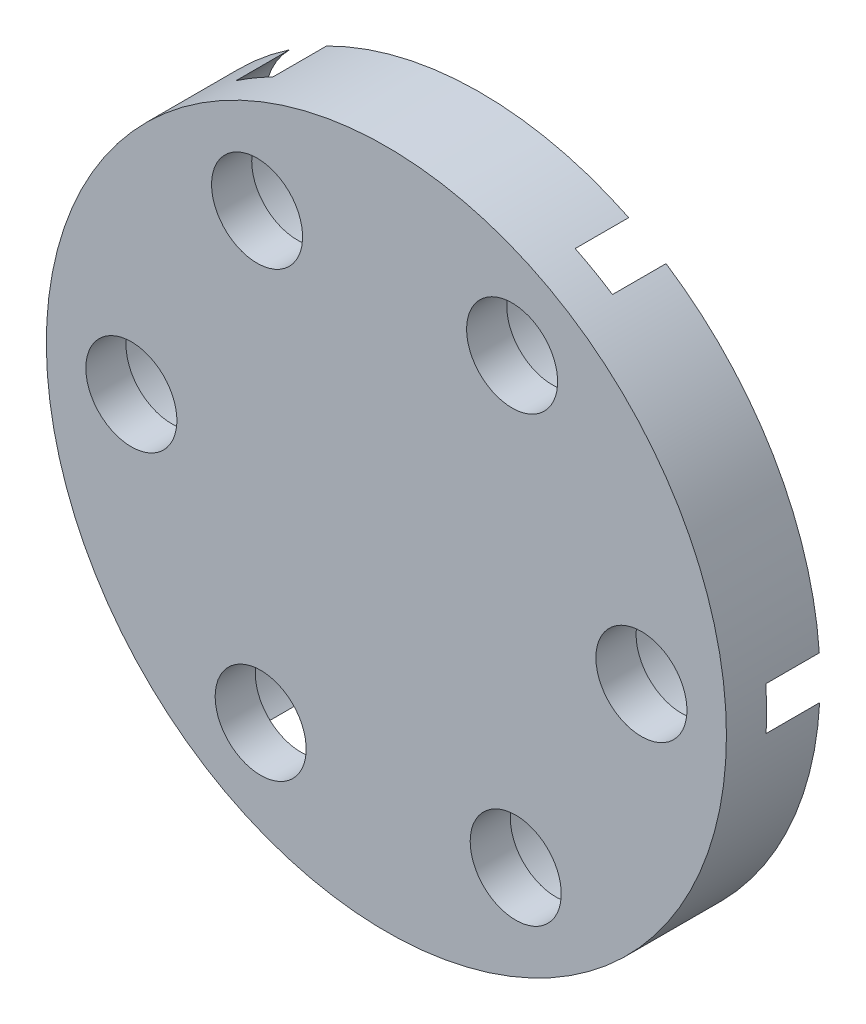
ISO-10303-21;
HEADER;
FILE_DESCRIPTION(('STEP AP214'),'2;1');
FILE_NAME('part.step','',(''),(''),'','','');
FILE_SCHEMA(('AUTOMOTIVE_DESIGN { 1 0 10303 214 1 1 1 1 }'));
ENDSEC;
DATA;
#1=APPLICATION_CONTEXT('core data for automotive mechanical design processes');
#2=APPLICATION_PROTOCOL_DEFINITION('international standard','automotive_design',2000,#1);
#3=PRODUCT_CONTEXT('',#1,'mechanical');
#4=PRODUCT('Part','Part','',(#3));
#5=PRODUCT_RELATED_PRODUCT_CATEGORY('part','',(#4));
#6=PRODUCT_DEFINITION_FORMATION('','',#4);
#7=PRODUCT_DEFINITION_CONTEXT('part definition',#1,'design');
#8=PRODUCT_DEFINITION('design','',#6,#7);
#9=PRODUCT_DEFINITION_SHAPE('','',#8);
#10=(LENGTH_UNIT() NAMED_UNIT(*) SI_UNIT(.MILLI.,.METRE.));
#11=(NAMED_UNIT(*) PLANE_ANGLE_UNIT() SI_UNIT($,.RADIAN.));
#12=(NAMED_UNIT(*) SI_UNIT($,.STERADIAN.) SOLID_ANGLE_UNIT());
#13=UNCERTAINTY_MEASURE_WITH_UNIT(LENGTH_MEASURE(1.E-05),#10,'distance_accuracy_value','');
#14=(GEOMETRIC_REPRESENTATION_CONTEXT(3) GLOBAL_UNCERTAINTY_ASSIGNED_CONTEXT((#13)) GLOBAL_UNIT_ASSIGNED_CONTEXT((#10,
#11,#12)) REPRESENTATION_CONTEXT('',''));
#15=CARTESIAN_POINT('',(0.,0.,0.));
#16=DIRECTION('',(0.,0.,1.));
#17=DIRECTION('',(1.,0.,0.));
#18=AXIS2_PLACEMENT_3D('',#15,#16,#17);
#19=CARTESIAN_POINT('',(0.,0.,0.));
#20=DIRECTION('',(0.,0.,1.));
#21=DIRECTION('',(1.,0.,0.));
#22=AXIS2_PLACEMENT_3D('',#19,#20,#21);
#23=PLANE('',#22);
#24=CARTESIAN_POINT('',(0.,0.,0.));
#25=DIRECTION('',(0.,0.,-1.));
#26=DIRECTION('',(-1.,0.,0.));
#27=AXIS2_PLACEMENT_3D('',#24,#25,#26);
#28=CIRCLE('',#27,6.275);
#29=CARTESIAN_POINT('',(-3.18179412178379,5.40849435301379,0.));
#30=VERTEX_POINT('',#29);
#31=CARTESIAN_POINT('',(3.09299644504274,5.45976171558365,0.));
#32=VERTEX_POINT('',#31);
#33=EDGE_CURVE('E169',#30,#32,#28,.T.);
#34=ORIENTED_EDGE('',*,*,#33,.F.);
#35=CARTESIAN_POINT('',(-4.82973530039691,8.20970656772213,0.));
#36=DIRECTION('',(0.,0.,-1.));
#37=DIRECTION('',(-1.,0.,0.));
#38=AXIS2_PLACEMENT_3D('',#35,#36,#37);
#39=CIRCLE('',#38,3.25);
#40=CARTESIAN_POINT('',(-5.73629038866502,11.3307092706904,0.));
#41=VERTEX_POINT('',#40);
#42=EDGE_CURVE('E145',#41,#30,#39,.T.);
#43=ORIENTED_EDGE('',*,*,#42,.F.);
#44=CARTESIAN_POINT('',(0.,0.,0.));
#45=DIRECTION('',(0.,0.,1.));
#46=DIRECTION('',(1.,0.,0.));
#47=AXIS2_PLACEMENT_3D('',#44,#45,#46);
#48=CIRCLE('',#47,12.7);
#49=CARTESIAN_POINT('',(5.55038476590794,11.4229255863101,0.));
#50=VERTEX_POINT('',#49);
#51=EDGE_CURVE('E324',#50,#41,#48,.T.);
#52=ORIENTED_EDGE('',*,*,#51,.F.);
#53=CARTESIAN_POINT('',(4.69494679506488,8.28752674755925,0.));
#54=DIRECTION('',(0.,0.,-1.));
#55=DIRECTION('',(-1.,0.,0.));
#56=AXIS2_PLACEMENT_3D('',#53,#54,#55);
#57=CIRCLE('',#56,3.25);
#58=EDGE_CURVE('E170',#32,#50,#57,.T.);
#59=ORIENTED_EDGE('',*,*,#58,.F.);
#60=EDGE_LOOP('',(#34,#43,#52,#59));
#61=FACE_BOUND('',#60,.T.);
#62=ADVANCED_FACE('F34',(#61),#23,.F.);
#63=CARTESIAN_POINT('',(6.27479056682652,0.0512673625698373,0.));
#64=VERTEX_POINT('',#63);
#65=EDGE_CURVE('E177',#32,#64,#28,.T.);
#66=ORIENTED_EDGE('',*,*,#65,.F.);
#67=CARTESIAN_POINT('',(6.94453687698126,10.6331278354136,0.));
#68=VERTEX_POINT('',#67);
#69=EDGE_CURVE('E224',#68,#32,#57,.T.);
#70=ORIENTED_EDGE('',*,*,#69,.F.);
#71=CARTESIAN_POINT('',(12.6677361262377,0.90468858510056,0.));
#72=VERTEX_POINT('',#71);
#73=EDGE_CURVE('E314',#72,#68,#48,.T.);
#74=ORIENTED_EDGE('',*,*,#73,.F.);
#75=CARTESIAN_POINT('',(9.52468209546178,0.0778201798370837,0.));
#76=DIRECTION('',(0.,0.,-1.));
#77=DIRECTION('',(-1.,0.,0.));
#78=AXIS2_PLACEMENT_3D('',#75,#76,#77);
#79=CIRCLE('',#78,3.25);
#80=EDGE_CURVE('E212',#64,#72,#79,.T.);
#81=ORIENTED_EDGE('',*,*,#80,.F.);
#82=EDGE_LOOP('',(#66,#70,#74,#81));
#83=FACE_BOUND('',#82,.T.);
#84=ADVANCED_FACE('F312',(#83),#23,.F.);
#85=CARTESIAN_POINT('',(3.18179412178376,-5.40849435301382,0.));
#86=VERTEX_POINT('',#85);
#87=EDGE_CURVE('E57',#64,#86,#28,.T.);
#88=ORIENTED_EDGE('',*,*,#87,.F.);
#89=CARTESIAN_POINT('',(12.6808272656462,-0.697581435276837,0.));
#90=VERTEX_POINT('',#89);
#91=EDGE_CURVE('E213',#90,#64,#79,.T.);
#92=ORIENTED_EDGE('',*,*,#91,.F.);
#93=CARTESIAN_POINT('',(7.11735136032973,-10.5182370012095,0.));
#94=VERTEX_POINT('',#93);
#95=EDGE_CURVE('E322',#94,#90,#48,.T.);
#96=ORIENTED_EDGE('',*,*,#95,.F.);
#97=CARTESIAN_POINT('',(4.82973530039686,-8.20970656772217,0.));
#98=DIRECTION('',(0.,0.,-1.));
#99=DIRECTION('',(-1.,0.,0.));
#100=AXIS2_PLACEMENT_3D('',#97,#98,#99);
#101=CIRCLE('',#100,3.25);
#102=EDGE_CURVE('E200',#86,#94,#101,.T.);
#103=ORIENTED_EDGE('',*,*,#102,.F.);
#104=EDGE_LOOP('',(#88,#92,#96,#103));
#105=FACE_BOUND('',#104,.T.);
#106=ADVANCED_FACE('F321',(#105),#23,.F.);
#107=CARTESIAN_POINT('',(-3.09299644504278,-5.45976171558363,0.));
#108=VERTEX_POINT('',#107);
#109=EDGE_CURVE('E50',#86,#108,#28,.T.);
#110=ORIENTED_EDGE('',*,*,#109,.F.);
#111=CARTESIAN_POINT('',(5.73629038866494,-11.3307092706904,0.));
#112=VERTEX_POINT('',#111);
#113=EDGE_CURVE('E201',#112,#86,#101,.T.);
#114=ORIENTED_EDGE('',*,*,#113,.F.);
#115=CARTESIAN_POINT('',(-5.55038476590804,-11.42292558631,0.));
#116=VERTEX_POINT('',#115);
#117=EDGE_CURVE('E261',#116,#112,#48,.T.);
#118=ORIENTED_EDGE('',*,*,#117,.F.);
#119=CARTESIAN_POINT('',(-4.69494679506494,-8.28752674755922,0.));
#120=DIRECTION('',(0.,0.,-1.));
#121=DIRECTION('',(-1.,0.,0.));
#122=AXIS2_PLACEMENT_3D('',#119,#120,#121);
#123=CIRCLE('',#122,3.25);
#124=EDGE_CURVE('E192',#108,#116,#123,.T.);
#125=ORIENTED_EDGE('',*,*,#124,.F.);
#126=EDGE_LOOP('',(#110,#114,#118,#125));
#127=FACE_BOUND('',#126,.T.);
#128=ADVANCED_FACE('F372',(#127),#23,.F.);
#129=CARTESIAN_POINT('',(-6.27479056682652,-0.051267362569883,0.));
#130=VERTEX_POINT('',#129);
#131=EDGE_CURVE('E180',#108,#130,#28,.T.);
#132=ORIENTED_EDGE('',*,*,#131,.F.);
#133=CARTESIAN_POINT('',(-6.94453687698132,-10.6331278354136,0.));
#134=VERTEX_POINT('',#133);
#135=EDGE_CURVE('E188',#134,#108,#123,.T.);
#136=ORIENTED_EDGE('',*,*,#135,.F.);
#137=CARTESIAN_POINT('',(-12.6677361262377,-0.904688585100667,0.));
#138=VERTEX_POINT('',#137);
#139=EDGE_CURVE('E258',#138,#134,#48,.T.);
#140=ORIENTED_EDGE('',*,*,#139,.F.);
#141=CARTESIAN_POINT('',(-9.52468209546178,-0.0778201798371531,0.));
#142=DIRECTION('',(0.,0.,-1.));
#143=DIRECTION('',(-1.,0.,0.));
#144=AXIS2_PLACEMENT_3D('',#141,#142,#143);
#145=CIRCLE('',#144,3.25);
#146=EDGE_CURVE('E241',#130,#138,#145,.T.);
#147=ORIENTED_EDGE('',*,*,#146,.F.);
#148=EDGE_LOOP('',(#132,#136,#140,#147));
#149=FACE_BOUND('',#148,.T.);
#150=ADVANCED_FACE('F337',(#149),#23,.F.);
#151=EDGE_CURVE('E163',#130,#30,#28,.T.);
#152=ORIENTED_EDGE('',*,*,#151,.F.);
#153=CARTESIAN_POINT('',(-12.6808272656462,0.697581435276758,0.));
#154=VERTEX_POINT('',#153);
#155=EDGE_CURVE('E242',#154,#130,#145,.T.);
#156=ORIENTED_EDGE('',*,*,#155,.F.);
#157=CARTESIAN_POINT('',(-7.11735136032981,10.5182370012094,0.));
#158=VERTEX_POINT('',#157);
#159=EDGE_CURVE('E165',#158,#154,#48,.T.);
#160=ORIENTED_EDGE('',*,*,#159,.F.);
#161=EDGE_CURVE('E148',#30,#158,#39,.T.);
#162=ORIENTED_EDGE('',*,*,#161,.F.);
#163=EDGE_LOOP('',(#152,#156,#160,#162));
#164=FACE_BOUND('',#163,.T.);
#165=ADVANCED_FACE('F160',(#164),#23,.F.);
#166=CARTESIAN_POINT('',(0.,0.,3.5));
#167=DIRECTION('',(0.,0.,-1.));
#168=DIRECTION('',(-1.,0.,0.));
#169=AXIS2_PLACEMENT_3D('',#166,#167,#168);
#170=CYLINDRICAL_SURFACE('',#169,12.7);
#171=ORIENTED_EDGE('',*,*,#139,.T.);
#172=DIRECTION('',(0.,0.,-1.));
#173=VECTOR('',#172,1.);
#174=CARTESIAN_POINT('',(-6.94453687698132,-10.6331278354136,1.));
#175=LINE('',#174,#173);
#176=CARTESIAN_POINT('',(-6.94453687698131,-10.6331278354136,2.));
#177=VERTEX_POINT('',#176);
#178=EDGE_CURVE('E181',#134,#177,#175,.F.);
#179=ORIENTED_EDGE('',*,*,#178,.T.);
#180=CARTESIAN_POINT('',(0.,0.,2.));
#181=DIRECTION('',(0.,0.,1.));
#182=DIRECTION('',(1.,0.,0.));
#183=AXIS2_PLACEMENT_3D('',#180,#181,#182);
#184=CIRCLE('',#183,12.7);
#185=CARTESIAN_POINT('',(-5.55038476590805,-11.42292558631,2.));
#186=VERTEX_POINT('',#185);
#187=EDGE_CURVE('E303',#177,#186,#184,.T.);
#188=ORIENTED_EDGE('',*,*,#187,.T.);
#189=DIRECTION('',(0.,0.,-1.));
#190=VECTOR('',#189,1.);
#191=CARTESIAN_POINT('',(-5.55038476590804,-11.42292558631,1.));
#192=LINE('',#191,#190);
#193=EDGE_CURVE('E183',#186,#116,#192,.T.);
#194=ORIENTED_EDGE('',*,*,#193,.T.);
#195=ORIENTED_EDGE('',*,*,#117,.T.);
#196=DIRECTION('',(0.,0.,-1.));
#197=VECTOR('',#196,1.);
#198=CARTESIAN_POINT('',(5.73629038866495,-11.3307092706904,1.));
#199=LINE('',#198,#197);
#200=CARTESIAN_POINT('',(5.73629038866495,-11.3307092706904,2.));
#201=VERTEX_POINT('',#200);
#202=EDGE_CURVE('E300',#112,#201,#199,.F.);
#203=ORIENTED_EDGE('',*,*,#202,.T.);
#204=CARTESIAN_POINT('',(0.,0.,2.));
#205=DIRECTION('',(0.,0.,1.));
#206=DIRECTION('',(1.,0.,0.));
#207=AXIS2_PLACEMENT_3D('',#204,#205,#206);
#208=CIRCLE('',#207,12.7);
#209=CARTESIAN_POINT('',(7.11735136032972,-10.5182370012095,2.));
#210=VERTEX_POINT('',#209);
#211=EDGE_CURVE('E294',#201,#210,#208,.T.);
#212=ORIENTED_EDGE('',*,*,#211,.T.);
#213=DIRECTION('',(0.,0.,-1.));
#214=VECTOR('',#213,1.);
#215=CARTESIAN_POINT('',(7.11735136032973,-10.5182370012095,1.));
#216=LINE('',#215,#214);
#217=EDGE_CURVE('E297',#210,#94,#216,.T.);
#218=ORIENTED_EDGE('',*,*,#217,.T.);
#219=ORIENTED_EDGE('',*,*,#95,.T.);
#220=DIRECTION('',(0.,0.,-1.));
#221=VECTOR('',#220,1.);
#222=CARTESIAN_POINT('',(12.6808272656462,-0.69758143527685,1.));
#223=LINE('',#222,#221);
#224=CARTESIAN_POINT('',(12.6808272656462,-0.697581435276837,2.));
#225=VERTEX_POINT('',#224);
#226=EDGE_CURVE('E291',#90,#225,#223,.F.);
#227=ORIENTED_EDGE('',*,*,#226,.T.);
#228=CARTESIAN_POINT('',(0.,0.,2.));
#229=DIRECTION('',(0.,0.,1.));
#230=DIRECTION('',(1.,0.,0.));
#231=AXIS2_PLACEMENT_3D('',#228,#229,#230);
#232=CIRCLE('',#231,12.7);
#233=CARTESIAN_POINT('',(12.6677361262377,0.90468858510056,2.));
#234=VERTEX_POINT('',#233);
#235=EDGE_CURVE('E285',#225,#234,#232,.T.);
#236=ORIENTED_EDGE('',*,*,#235,.T.);
#237=DIRECTION('',(0.,0.,-1.));
#238=VECTOR('',#237,1.);
#239=CARTESIAN_POINT('',(12.6677361262377,0.904688585100572,1.));
#240=LINE('',#239,#238);
#241=EDGE_CURVE('E288',#234,#72,#240,.T.);
#242=ORIENTED_EDGE('',*,*,#241,.T.);
#243=ORIENTED_EDGE('',*,*,#73,.T.);
#244=DIRECTION('',(0.,0.,-1.));
#245=VECTOR('',#244,1.);
#246=CARTESIAN_POINT('',(6.94453687698126,10.6331278354136,1.));
#247=LINE('',#246,#245);
#248=CARTESIAN_POINT('',(6.94453687698125,10.6331278354136,2.));
#249=VERTEX_POINT('',#248);
#250=EDGE_CURVE('E282',#68,#249,#247,.F.);
#251=ORIENTED_EDGE('',*,*,#250,.T.);
#252=CARTESIAN_POINT('',(0.,0.,2.));
#253=DIRECTION('',(0.,0.,1.));
#254=DIRECTION('',(1.,0.,0.));
#255=AXIS2_PLACEMENT_3D('',#252,#253,#254);
#256=CIRCLE('',#255,12.7);
#257=CARTESIAN_POINT('',(5.55038476590795,11.4229255863101,2.));
#258=VERTEX_POINT('',#257);
#259=EDGE_CURVE('E276',#249,#258,#256,.T.);
#260=ORIENTED_EDGE('',*,*,#259,.T.);
#261=DIRECTION('',(0.,0.,-1.));
#262=VECTOR('',#261,1.);
#263=CARTESIAN_POINT('',(5.55038476590795,11.4229255863101,1.));
#264=LINE('',#263,#262);
#265=EDGE_CURVE('E279',#258,#50,#264,.T.);
#266=ORIENTED_EDGE('',*,*,#265,.T.);
#267=ORIENTED_EDGE('',*,*,#51,.T.);
#268=DIRECTION('',(0.,0.,-1.));
#269=VECTOR('',#268,1.);
#270=CARTESIAN_POINT('',(-5.73629038866501,11.3307092706904,1.));
#271=LINE('',#270,#269);
#272=CARTESIAN_POINT('',(-5.73629038866502,11.3307092706904,2.));
#273=VERTEX_POINT('',#272);
#274=EDGE_CURVE('E152',#41,#273,#271,.F.);
#275=ORIENTED_EDGE('',*,*,#274,.T.);
#276=CARTESIAN_POINT('',(0.,0.,2.));
#277=DIRECTION('',(0.,0.,1.));
#278=DIRECTION('',(1.,0.,0.));
#279=AXIS2_PLACEMENT_3D('',#276,#277,#278);
#280=CIRCLE('',#279,12.7);
#281=CARTESIAN_POINT('',(-7.11735136032981,10.5182370012094,2.));
#282=VERTEX_POINT('',#281);
#283=EDGE_CURVE('E272',#273,#282,#280,.T.);
#284=ORIENTED_EDGE('',*,*,#283,.T.);
#285=DIRECTION('',(0.,0.,-1.));
#286=VECTOR('',#285,1.);
#287=CARTESIAN_POINT('',(-7.11735136032981,10.5182370012094,1.));
#288=LINE('',#287,#286);
#289=EDGE_CURVE('E270',#282,#158,#288,.T.);
#290=ORIENTED_EDGE('',*,*,#289,.T.);
#291=ORIENTED_EDGE('',*,*,#159,.T.);
#292=DIRECTION('',(0.,0.,-1.));
#293=VECTOR('',#292,1.);
#294=CARTESIAN_POINT('',(-12.6808272656462,0.697581435276758,1.));
#295=LINE('',#294,#293);
#296=CARTESIAN_POINT('',(-12.6808272656462,0.697581435276757,2.));
#297=VERTEX_POINT('',#296);
#298=EDGE_CURVE('E267',#154,#297,#295,.F.);
#299=ORIENTED_EDGE('',*,*,#298,.T.);
#300=CARTESIAN_POINT('',(0.,0.,2.));
#301=DIRECTION('',(0.,0.,1.));
#302=DIRECTION('',(1.,0.,0.));
#303=AXIS2_PLACEMENT_3D('',#300,#301,#302);
#304=CIRCLE('',#303,12.7);
#305=CARTESIAN_POINT('',(-12.6677361262377,-0.904688585100667,2.));
#306=VERTEX_POINT('',#305);
#307=EDGE_CURVE('E264',#297,#306,#304,.T.);
#308=ORIENTED_EDGE('',*,*,#307,.T.);
#309=DIRECTION('',(0.,0.,-1.));
#310=VECTOR('',#309,1.);
#311=CARTESIAN_POINT('',(-12.6677361262377,-0.904688585100665,1.));
#312=LINE('',#311,#310);
#313=EDGE_CURVE('E257',#306,#138,#312,.T.);
#314=ORIENTED_EDGE('',*,*,#313,.T.);
#315=EDGE_LOOP('',(#171,#179,#188,#194,#195,#203,#212,#218,#219,#227,#236,#242,#243,#251,#260,
#266,#267,#275,#284,#290,#291,#299,#308,#314));
#316=FACE_BOUND('',#315,.T.);
#317=CARTESIAN_POINT('',(0.,0.,3.5));
#318=DIRECTION('',(0.,0.,1.));
#319=DIRECTION('',(1.,0.,0.));
#320=AXIS2_PLACEMENT_3D('',#317,#318,#319);
#321=CIRCLE('',#320,12.7);
#322=CARTESIAN_POINT('',(12.7,0.,3.5));
#323=VERTEX_POINT('',#322);
#324=EDGE_CURVE('E254',#323,#323,#321,.T.);
#325=ORIENTED_EDGE('',*,*,#324,.F.);
#326=EDGE_LOOP('',(#325));
#327=FACE_BOUND('',#326,.T.);
#328=ADVANCED_FACE('F327',(#316,#327),#170,.T.);
#329=CARTESIAN_POINT('',(0.,0.,3.5));
#330=DIRECTION('',(0.,0.,1.));
#331=DIRECTION('',(1.,0.,0.));
#332=AXIS2_PLACEMENT_3D('',#329,#330,#331);
#333=PLANE('',#332);
#334=CARTESIAN_POINT('',(-4.69494679506494,-8.28752674755922,3.5));
#335=DIRECTION('',(0.,0.,-1.));
#336=DIRECTION('',(-1.,0.,0.));
#337=AXIS2_PLACEMENT_3D('',#334,#335,#336);
#338=CIRCLE('',#337,1.7);
#339=CARTESIAN_POINT('',(-6.39494679506494,-8.28752674755922,3.5));
#340=VERTEX_POINT('',#339);
#341=EDGE_CURVE('E197',#340,#340,#338,.T.);
#342=ORIENTED_EDGE('',*,*,#341,.T.);
#343=EDGE_LOOP('',(#342));
#344=FACE_BOUND('',#343,.T.);
#345=CARTESIAN_POINT('',(4.82973530039686,-8.20970656772217,3.5));
#346=DIRECTION('',(0.,0.,-1.));
#347=DIRECTION('',(-1.,0.,0.));
#348=AXIS2_PLACEMENT_3D('',#345,#346,#347);
#349=CIRCLE('',#348,1.7);
#350=CARTESIAN_POINT('',(3.12973530039686,-8.20970656772217,3.5));
#351=VERTEX_POINT('',#350);
#352=EDGE_CURVE('E209',#351,#351,#349,.T.);
#353=ORIENTED_EDGE('',*,*,#352,.T.);
#354=EDGE_LOOP('',(#353));
#355=FACE_BOUND('',#354,.T.);
#356=CARTESIAN_POINT('',(9.52468209546178,0.0778201798370837,3.5));
#357=DIRECTION('',(0.,0.,-1.));
#358=DIRECTION('',(-1.,0.,0.));
#359=AXIS2_PLACEMENT_3D('',#356,#357,#358);
#360=CIRCLE('',#359,1.7);
#361=CARTESIAN_POINT('',(7.82468209546178,0.0778201798370837,3.5));
#362=VERTEX_POINT('',#361);
#363=EDGE_CURVE('E221',#362,#362,#360,.T.);
#364=ORIENTED_EDGE('',*,*,#363,.T.);
#365=EDGE_LOOP('',(#364));
#366=FACE_BOUND('',#365,.T.);
#367=CARTESIAN_POINT('',(4.69494679506488,8.28752674755925,3.5));
#368=DIRECTION('',(0.,0.,-1.));
#369=DIRECTION('',(-1.,0.,0.));
#370=AXIS2_PLACEMENT_3D('',#367,#368,#369);
#371=CIRCLE('',#370,1.7);
#372=CARTESIAN_POINT('',(2.99494679506488,8.28752674755925,3.5));
#373=VERTEX_POINT('',#372);
#374=EDGE_CURVE('E166',#373,#373,#371,.T.);
#375=ORIENTED_EDGE('',*,*,#374,.T.);
#376=EDGE_LOOP('',(#375));
#377=FACE_BOUND('',#376,.T.);
#378=CARTESIAN_POINT('',(-4.82973530039691,8.20970656772213,3.5));
#379=DIRECTION('',(0.,0.,-1.));
#380=DIRECTION('',(-1.,0.,0.));
#381=AXIS2_PLACEMENT_3D('',#378,#379,#380);
#382=CIRCLE('',#381,1.7);
#383=CARTESIAN_POINT('',(-6.52973530039691,8.20970656772213,3.5));
#384=VERTEX_POINT('',#383);
#385=EDGE_CURVE('E238',#384,#384,#382,.T.);
#386=ORIENTED_EDGE('',*,*,#385,.T.);
#387=EDGE_LOOP('',(#386));
#388=FACE_BOUND('',#387,.T.);
#389=CARTESIAN_POINT('',(-9.52468209546178,-0.0778201798371531,3.5));
#390=DIRECTION('',(0.,0.,-1.));
#391=DIRECTION('',(-1.,0.,0.));
#392=AXIS2_PLACEMENT_3D('',#389,#390,#391);
#393=CIRCLE('',#392,1.7);
#394=CARTESIAN_POINT('',(-11.2246820954618,-0.0778201798371531,3.5));
#395=VERTEX_POINT('',#394);
#396=EDGE_CURVE('E251',#395,#395,#393,.T.);
#397=ORIENTED_EDGE('',*,*,#396,.T.);
#398=EDGE_LOOP('',(#397));
#399=FACE_BOUND('',#398,.T.);
#400=ORIENTED_EDGE('',*,*,#324,.T.);
#401=EDGE_LOOP('',(#400));
#402=FACE_BOUND('',#401,.T.);
#403=ADVANCED_FACE('F371',(#344,#355,#366,#377,#388,#399,#402),#333,.T.);
#404=CARTESIAN_POINT('',(-7.82468209546178,-0.0778201798371531,2.));
#405=DIRECTION('',(0.,0.,1.));
#406=DIRECTION('',(1.,0.,0.));
#407=AXIS2_PLACEMENT_3D('',#404,#405,#406);
#408=PLANE('',#407);
#409=CARTESIAN_POINT('',(-9.52468209546178,-0.0778201798371531,2.));
#410=DIRECTION('',(0.,0.,-1.));
#411=DIRECTION('',(-1.,0.,0.));
#412=AXIS2_PLACEMENT_3D('',#409,#410,#411);
#413=CIRCLE('',#412,1.7);
#414=CARTESIAN_POINT('',(-11.2246820954618,-0.0778201798371531,2.));
#415=VERTEX_POINT('',#414);
#416=EDGE_CURVE('E248',#415,#415,#413,.T.);
#417=ORIENTED_EDGE('',*,*,#416,.F.);
#418=EDGE_LOOP('',(#417));
#419=FACE_BOUND('',#418,.T.);
#420=CARTESIAN_POINT('',(-9.52468209546178,-0.0778201798371531,2.));
#421=DIRECTION('',(0.,0.,-1.));
#422=DIRECTION('',(-1.,0.,0.));
#423=AXIS2_PLACEMENT_3D('',#420,#421,#422);
#424=CIRCLE('',#423,3.25);
#425=EDGE_CURVE('E245',#297,#306,#424,.T.);
#426=ORIENTED_EDGE('',*,*,#425,.T.);
#427=ORIENTED_EDGE('',*,*,#307,.F.);
#428=EDGE_LOOP('',(#426,#427));
#429=FACE_BOUND('',#428,.T.);
#430=ADVANCED_FACE('F333',(#419,#429),#408,.F.);
#431=CARTESIAN_POINT('',(-9.52468209546178,-0.0778201798371531,0.));
#432=DIRECTION('',(0.,0.,-1.));
#433=DIRECTION('',(-1.,0.,0.));
#434=AXIS2_PLACEMENT_3D('',#431,#432,#433);
#435=CYLINDRICAL_SURFACE('',#434,3.25);
#436=ORIENTED_EDGE('',*,*,#155,.T.);
#437=ORIENTED_EDGE('',*,*,#146,.T.);
#438=ORIENTED_EDGE('',*,*,#313,.F.);
#439=ORIENTED_EDGE('',*,*,#425,.F.);
#440=ORIENTED_EDGE('',*,*,#298,.F.);
#441=EDGE_LOOP('',(#436,#437,#438,#439,#440));
#442=FACE_BOUND('',#441,.T.);
#443=ADVANCED_FACE('F331',(#442),#435,.F.);
#444=CARTESIAN_POINT('',(-9.52468209546178,-0.0778201798371531,0.));
#445=DIRECTION('',(0.,0.,-1.));
#446=DIRECTION('',(-1.,0.,0.));
#447=AXIS2_PLACEMENT_3D('',#444,#445,#446);
#448=CYLINDRICAL_SURFACE('',#447,1.7);
#449=ORIENTED_EDGE('',*,*,#396,.F.);
#450=EDGE_LOOP('',(#449));
#451=FACE_BOUND('',#450,.T.);
#452=ORIENTED_EDGE('',*,*,#416,.T.);
#453=EDGE_LOOP('',(#452));
#454=FACE_BOUND('',#453,.T.);
#455=ADVANCED_FACE('F540',(#451,#454),#448,.F.);
#456=CARTESIAN_POINT('',(-3.12973530039691,8.20970656772213,2.));
#457=DIRECTION('',(0.,0.,1.));
#458=DIRECTION('',(1.,0.,0.));
#459=AXIS2_PLACEMENT_3D('',#456,#457,#458);
#460=PLANE('',#459);
#461=CARTESIAN_POINT('',(-4.82973530039691,8.20970656772213,2.));
#462=DIRECTION('',(0.,0.,-1.));
#463=DIRECTION('',(-1.,0.,0.));
#464=AXIS2_PLACEMENT_3D('',#461,#462,#463);
#465=CIRCLE('',#464,1.7);
#466=CARTESIAN_POINT('',(-6.52973530039691,8.20970656772213,2.));
#467=VERTEX_POINT('',#466);
#468=EDGE_CURVE('E235',#467,#467,#465,.T.);
#469=ORIENTED_EDGE('',*,*,#468,.F.);
#470=EDGE_LOOP('',(#469));
#471=FACE_BOUND('',#470,.T.);
#472=CARTESIAN_POINT('',(-4.82973530039691,8.20970656772213,2.));
#473=DIRECTION('',(0.,0.,-1.));
#474=DIRECTION('',(-1.,0.,0.));
#475=AXIS2_PLACEMENT_3D('',#472,#473,#474);
#476=CIRCLE('',#475,3.25);
#477=EDGE_CURVE('E156',#273,#282,#476,.T.);
#478=ORIENTED_EDGE('',*,*,#477,.T.);
#479=ORIENTED_EDGE('',*,*,#283,.F.);
#480=EDGE_LOOP('',(#478,#479));
#481=FACE_BOUND('',#480,.T.);
#482=ADVANCED_FACE('F535',(#471,#481),#460,.F.);
#483=CARTESIAN_POINT('',(-4.82973530039691,8.20970656772213,0.));
#484=DIRECTION('',(0.,0.,-1.));
#485=DIRECTION('',(-1.,0.,0.));
#486=AXIS2_PLACEMENT_3D('',#483,#484,#485);
#487=CYLINDRICAL_SURFACE('',#486,3.25);
#488=ORIENTED_EDGE('',*,*,#42,.T.);
#489=ORIENTED_EDGE('',*,*,#161,.T.);
#490=ORIENTED_EDGE('',*,*,#289,.F.);
#491=ORIENTED_EDGE('',*,*,#477,.F.);
#492=ORIENTED_EDGE('',*,*,#274,.F.);
#493=EDGE_LOOP('',(#488,#489,#490,#491,#492));
#494=FACE_BOUND('',#493,.T.);
#495=ADVANCED_FACE('F147',(#494),#487,.F.);
#496=CARTESIAN_POINT('',(-4.82973530039691,8.20970656772213,0.));
#497=DIRECTION('',(0.,0.,-1.));
#498=DIRECTION('',(-1.,0.,0.));
#499=AXIS2_PLACEMENT_3D('',#496,#497,#498);
#500=CYLINDRICAL_SURFACE('',#499,1.7);
#501=ORIENTED_EDGE('',*,*,#385,.F.);
#502=EDGE_LOOP('',(#501));
#503=FACE_BOUND('',#502,.T.);
#504=ORIENTED_EDGE('',*,*,#468,.T.);
#505=EDGE_LOOP('',(#504));
#506=FACE_BOUND('',#505,.T.);
#507=ADVANCED_FACE('F523',(#503,#506),#500,.F.);
#508=CARTESIAN_POINT('',(4.69494679506488,8.28752674755925,0.));
#509=DIRECTION('',(0.,0.,-1.));
#510=DIRECTION('',(-1.,0.,0.));
#511=AXIS2_PLACEMENT_3D('',#508,#509,#510);
#512=CYLINDRICAL_SURFACE('',#511,3.25);
#513=ORIENTED_EDGE('',*,*,#69,.T.);
#514=ORIENTED_EDGE('',*,*,#58,.T.);
#515=ORIENTED_EDGE('',*,*,#265,.F.);
#516=CARTESIAN_POINT('',(4.69494679506488,8.28752674755925,2.));
#517=DIRECTION('',(0.,0.,-1.));
#518=DIRECTION('',(-1.,0.,0.));
#519=AXIS2_PLACEMENT_3D('',#516,#517,#518);
#520=CIRCLE('',#519,3.25);
#521=EDGE_CURVE('E226',#249,#258,#520,.T.);
#522=ORIENTED_EDGE('',*,*,#521,.F.);
#523=ORIENTED_EDGE('',*,*,#250,.F.);
#524=EDGE_LOOP('',(#513,#514,#515,#522,#523));
#525=FACE_BOUND('',#524,.T.);
#526=ADVANCED_FACE('F515',(#525),#512,.F.);
#527=CARTESIAN_POINT('',(6.39494679506488,8.28752674755925,2.));
#528=DIRECTION('',(0.,0.,1.));
#529=DIRECTION('',(1.,0.,0.));
#530=AXIS2_PLACEMENT_3D('',#527,#528,#529);
#531=PLANE('',#530);
#532=CARTESIAN_POINT('',(4.69494679506488,8.28752674755925,2.));
#533=DIRECTION('',(0.,0.,-1.));
#534=DIRECTION('',(-1.,0.,0.));
#535=AXIS2_PLACEMENT_3D('',#532,#533,#534);
#536=CIRCLE('',#535,1.7);
#537=CARTESIAN_POINT('',(2.99494679506488,8.28752674755925,2.));
#538=VERTEX_POINT('',#537);
#539=EDGE_CURVE('E228',#538,#538,#536,.T.);
#540=ORIENTED_EDGE('',*,*,#539,.F.);
#541=EDGE_LOOP('',(#540));
#542=FACE_BOUND('',#541,.T.);
#543=ORIENTED_EDGE('',*,*,#521,.T.);
#544=ORIENTED_EDGE('',*,*,#259,.F.);
#545=EDGE_LOOP('',(#543,#544));
#546=FACE_BOUND('',#545,.T.);
#547=ADVANCED_FACE('F505',(#542,#546),#531,.F.);
#548=CARTESIAN_POINT('',(4.69494679506488,8.28752674755925,0.));
#549=DIRECTION('',(0.,0.,-1.));
#550=DIRECTION('',(-1.,0.,0.));
#551=AXIS2_PLACEMENT_3D('',#548,#549,#550);
#552=CYLINDRICAL_SURFACE('',#551,1.7);
#553=ORIENTED_EDGE('',*,*,#374,.F.);
#554=EDGE_LOOP('',(#553));
#555=FACE_BOUND('',#554,.T.);
#556=ORIENTED_EDGE('',*,*,#539,.T.);
#557=EDGE_LOOP('',(#556));
#558=FACE_BOUND('',#557,.T.);
#559=ADVANCED_FACE('F500',(#555,#558),#552,.F.);
#560=CARTESIAN_POINT('',(9.52468209546178,0.0778201798370837,0.));
#561=DIRECTION('',(0.,0.,-1.));
#562=DIRECTION('',(-1.,0.,0.));
#563=AXIS2_PLACEMENT_3D('',#560,#561,#562);
#564=CYLINDRICAL_SURFACE('',#563,3.25);
#565=ORIENTED_EDGE('',*,*,#91,.T.);
#566=ORIENTED_EDGE('',*,*,#80,.T.);
#567=ORIENTED_EDGE('',*,*,#241,.F.);
#568=CARTESIAN_POINT('',(9.52468209546178,0.0778201798370837,2.));
#569=DIRECTION('',(0.,0.,-1.));
#570=DIRECTION('',(-1.,0.,0.));
#571=AXIS2_PLACEMENT_3D('',#568,#569,#570);
#572=CIRCLE('',#571,3.25);
#573=EDGE_CURVE('E216',#225,#234,#572,.T.);
#574=ORIENTED_EDGE('',*,*,#573,.F.);
#575=ORIENTED_EDGE('',*,*,#226,.F.);
#576=EDGE_LOOP('',(#565,#566,#567,#574,#575));
#577=FACE_BOUND('',#576,.T.);
#578=ADVANCED_FACE('F318',(#577),#564,.F.);
#579=CARTESIAN_POINT('',(11.2246820954618,0.0778201798370837,2.));
#580=DIRECTION('',(0.,0.,1.));
#581=DIRECTION('',(1.,0.,0.));
#582=AXIS2_PLACEMENT_3D('',#579,#580,#581);
#583=PLANE('',#582);
#584=CARTESIAN_POINT('',(9.52468209546178,0.0778201798370837,2.));
#585=DIRECTION('',(0.,0.,-1.));
#586=DIRECTION('',(-1.,0.,0.));
#587=AXIS2_PLACEMENT_3D('',#584,#585,#586);
#588=CIRCLE('',#587,1.7);
#589=CARTESIAN_POINT('',(7.82468209546178,0.0778201798370837,2.));
#590=VERTEX_POINT('',#589);
#591=EDGE_CURVE('E218',#590,#590,#588,.T.);
#592=ORIENTED_EDGE('',*,*,#591,.F.);
#593=EDGE_LOOP('',(#592));
#594=FACE_BOUND('',#593,.T.);
#595=ORIENTED_EDGE('',*,*,#573,.T.);
#596=ORIENTED_EDGE('',*,*,#235,.F.);
#597=EDGE_LOOP('',(#595,#596));
#598=FACE_BOUND('',#597,.T.);
#599=ADVANCED_FACE('F483',(#594,#598),#583,.F.);
#600=CARTESIAN_POINT('',(9.52468209546178,0.0778201798370837,0.));
#601=DIRECTION('',(0.,0.,-1.));
#602=DIRECTION('',(-1.,0.,0.));
#603=AXIS2_PLACEMENT_3D('',#600,#601,#602);
#604=CYLINDRICAL_SURFACE('',#603,1.7);
#605=ORIENTED_EDGE('',*,*,#363,.F.);
#606=EDGE_LOOP('',(#605));
#607=FACE_BOUND('',#606,.T.);
#608=ORIENTED_EDGE('',*,*,#591,.T.);
#609=EDGE_LOOP('',(#608));
#610=FACE_BOUND('',#609,.T.);
#611=ADVANCED_FACE('F478',(#607,#610),#604,.F.);
#612=CARTESIAN_POINT('',(4.82973530039686,-8.20970656772217,0.));
#613=DIRECTION('',(0.,0.,-1.));
#614=DIRECTION('',(-1.,0.,0.));
#615=AXIS2_PLACEMENT_3D('',#612,#613,#614);
#616=CYLINDRICAL_SURFACE('',#615,3.25);
#617=ORIENTED_EDGE('',*,*,#113,.T.);
#618=ORIENTED_EDGE('',*,*,#102,.T.);
#619=ORIENTED_EDGE('',*,*,#217,.F.);
#620=CARTESIAN_POINT('',(4.82973530039686,-8.20970656772217,2.));
#621=DIRECTION('',(0.,0.,-1.));
#622=DIRECTION('',(-1.,0.,0.));
#623=AXIS2_PLACEMENT_3D('',#620,#621,#622);
#624=CIRCLE('',#623,3.25);
#625=EDGE_CURVE('E204',#201,#210,#624,.T.);
#626=ORIENTED_EDGE('',*,*,#625,.F.);
#627=ORIENTED_EDGE('',*,*,#202,.F.);
#628=EDGE_LOOP('',(#617,#618,#619,#626,#627));
#629=FACE_BOUND('',#628,.T.);
#630=ADVANCED_FACE('F470',(#629),#616,.F.);
#631=CARTESIAN_POINT('',(6.52973530039686,-8.20970656772217,2.));
#632=DIRECTION('',(0.,0.,1.));
#633=DIRECTION('',(1.,0.,0.));
#634=AXIS2_PLACEMENT_3D('',#631,#632,#633);
#635=PLANE('',#634);
#636=CARTESIAN_POINT('',(4.82973530039686,-8.20970656772217,2.));
#637=DIRECTION('',(0.,0.,-1.));
#638=DIRECTION('',(-1.,0.,0.));
#639=AXIS2_PLACEMENT_3D('',#636,#637,#638);
#640=CIRCLE('',#639,1.7);
#641=CARTESIAN_POINT('',(3.12973530039686,-8.20970656772217,2.));
#642=VERTEX_POINT('',#641);
#643=EDGE_CURVE('E206',#642,#642,#640,.T.);
#644=ORIENTED_EDGE('',*,*,#643,.F.);
#645=EDGE_LOOP('',(#644));
#646=FACE_BOUND('',#645,.T.);
#647=ORIENTED_EDGE('',*,*,#625,.T.);
#648=ORIENTED_EDGE('',*,*,#211,.F.);
#649=EDGE_LOOP('',(#647,#648));
#650=FACE_BOUND('',#649,.T.);
#651=ADVANCED_FACE('F460',(#646,#650),#635,.F.);
#652=CARTESIAN_POINT('',(4.82973530039686,-8.20970656772217,0.));
#653=DIRECTION('',(0.,0.,-1.));
#654=DIRECTION('',(-1.,0.,0.));
#655=AXIS2_PLACEMENT_3D('',#652,#653,#654);
#656=CYLINDRICAL_SURFACE('',#655,1.7);
#657=ORIENTED_EDGE('',*,*,#352,.F.);
#658=EDGE_LOOP('',(#657));
#659=FACE_BOUND('',#658,.T.);
#660=ORIENTED_EDGE('',*,*,#643,.T.);
#661=EDGE_LOOP('',(#660));
#662=FACE_BOUND('',#661,.T.);
#663=ADVANCED_FACE('F356',(#659,#662),#656,.F.);
#664=CARTESIAN_POINT('',(-4.69494679506494,-8.28752674755922,0.));
#665=DIRECTION('',(0.,0.,-1.));
#666=DIRECTION('',(-1.,0.,0.));
#667=AXIS2_PLACEMENT_3D('',#664,#665,#666);
#668=CYLINDRICAL_SURFACE('',#667,3.25);
#669=ORIENTED_EDGE('',*,*,#135,.T.);
#670=ORIENTED_EDGE('',*,*,#124,.T.);
#671=ORIENTED_EDGE('',*,*,#193,.F.);
#672=CARTESIAN_POINT('',(-4.69494679506494,-8.28752674755922,2.));
#673=DIRECTION('',(0.,0.,-1.));
#674=DIRECTION('',(-1.,0.,0.));
#675=AXIS2_PLACEMENT_3D('',#672,#673,#674);
#676=CIRCLE('',#675,3.25);
#677=EDGE_CURVE('E191',#177,#186,#676,.T.);
#678=ORIENTED_EDGE('',*,*,#677,.F.);
#679=ORIENTED_EDGE('',*,*,#178,.F.);
#680=EDGE_LOOP('',(#669,#670,#671,#678,#679));
#681=FACE_BOUND('',#680,.T.);
#682=ADVANCED_FACE('F339',(#681),#668,.F.);
#683=CARTESIAN_POINT('',(-2.99494679506494,-8.28752674755922,2.));
#684=DIRECTION('',(0.,0.,1.));
#685=DIRECTION('',(1.,0.,0.));
#686=AXIS2_PLACEMENT_3D('',#683,#684,#685);
#687=PLANE('',#686);
#688=CARTESIAN_POINT('',(-4.69494679506494,-8.28752674755922,2.));
#689=DIRECTION('',(0.,0.,-1.));
#690=DIRECTION('',(-1.,0.,0.));
#691=AXIS2_PLACEMENT_3D('',#688,#689,#690);
#692=CIRCLE('',#691,1.7);
#693=CARTESIAN_POINT('',(-6.39494679506494,-8.28752674755922,2.));
#694=VERTEX_POINT('',#693);
#695=EDGE_CURVE('E194',#694,#694,#692,.T.);
#696=ORIENTED_EDGE('',*,*,#695,.F.);
#697=EDGE_LOOP('',(#696));
#698=FACE_BOUND('',#697,.T.);
#699=ORIENTED_EDGE('',*,*,#677,.T.);
#700=ORIENTED_EDGE('',*,*,#187,.F.);
#701=EDGE_LOOP('',(#699,#700));
#702=FACE_BOUND('',#701,.T.);
#703=ADVANCED_FACE('F344',(#698,#702),#687,.F.);
#704=CARTESIAN_POINT('',(-4.69494679506494,-8.28752674755922,0.));
#705=DIRECTION('',(0.,0.,-1.));
#706=DIRECTION('',(-1.,0.,0.));
#707=AXIS2_PLACEMENT_3D('',#704,#705,#706);
#708=CYLINDRICAL_SURFACE('',#707,1.7);
#709=ORIENTED_EDGE('',*,*,#341,.F.);
#710=EDGE_LOOP('',(#709));
#711=FACE_BOUND('',#710,.T.);
#712=ORIENTED_EDGE('',*,*,#695,.T.);
#713=EDGE_LOOP('',(#712));
#714=FACE_BOUND('',#713,.T.);
#715=ADVANCED_FACE('F346',(#711,#714),#708,.F.);
#716=CARTESIAN_POINT('',(0.,0.,-1.));
#717=DIRECTION('',(0.,0.,-1.));
#718=DIRECTION('',(-1.,0.,0.));
#719=AXIS2_PLACEMENT_3D('',#716,#717,#718);
#720=PLANE('',#719);
#721=CARTESIAN_POINT('',(0.,0.,-1.));
#722=DIRECTION('',(0.,0.,-1.));
#723=DIRECTION('',(-1.,0.,0.));
#724=AXIS2_PLACEMENT_3D('',#721,#722,#723);
#725=CIRCLE('',#724,4.2);
#726=CARTESIAN_POINT('',(-4.2,0.,-1.));
#727=VERTEX_POINT('',#726);
#728=EDGE_CURVE('E11',#727,#727,#725,.F.);
#729=ORIENTED_EDGE('',*,*,#728,.T.);
#730=EDGE_LOOP('',(#729));
#731=FACE_BOUND('',#730,.T.);
#732=CARTESIAN_POINT('',(0.,0.,-1.));
#733=DIRECTION('',(0.,0.,-1.));
#734=DIRECTION('',(-1.,0.,0.));
#735=AXIS2_PLACEMENT_3D('',#732,#733,#734);
#736=CIRCLE('',#735,6.275);
#737=CARTESIAN_POINT('',(-6.275,0.,-1.));
#738=VERTEX_POINT('',#737);
#739=EDGE_CURVE('E174',#738,#738,#736,.T.);
#740=ORIENTED_EDGE('',*,*,#739,.T.);
#741=EDGE_LOOP('',(#740));
#742=FACE_BOUND('',#741,.T.);
#743=ADVANCED_FACE('F353',(#731,#742),#720,.T.);
#744=CARTESIAN_POINT('',(0.,0.,-1.));
#745=DIRECTION('',(0.,0.,1.));
#746=DIRECTION('',(1.,0.,0.));
#747=AXIS2_PLACEMENT_3D('',#744,#745,#746);
#748=CYLINDRICAL_SURFACE('',#747,6.275);
#749=ORIENTED_EDGE('',*,*,#739,.F.);
#750=EDGE_LOOP('',(#749));
#751=FACE_BOUND('',#750,.T.);
#752=ORIENTED_EDGE('',*,*,#33,.T.);
#753=ORIENTED_EDGE('',*,*,#65,.T.);
#754=ORIENTED_EDGE('',*,*,#87,.T.);
#755=ORIENTED_EDGE('',*,*,#109,.T.);
#756=ORIENTED_EDGE('',*,*,#131,.T.);
#757=ORIENTED_EDGE('',*,*,#151,.T.);
#758=EDGE_LOOP('',(#752,#753,#754,#755,#756,#757));
#759=FACE_BOUND('',#758,.T.);
#760=ADVANCED_FACE('F179',(#751,#759),#748,.T.);
#761=CARTESIAN_POINT('',(0.,0.,-1.));
#762=DIRECTION('',(0.,0.,1.));
#763=DIRECTION('',(1.,0.,0.));
#764=AXIS2_PLACEMENT_3D('',#761,#762,#763);
#765=CYLINDRICAL_SURFACE('',#764,4.);
#766=CARTESIAN_POINT('',(0.,0.,-0.800000000000003));
#767=DIRECTION('',(0.,0.,-1.));
#768=DIRECTION('',(-1.,0.,0.));
#769=AXIS2_PLACEMENT_3D('',#766,#767,#768);
#770=CIRCLE('',#769,4.);
#771=CARTESIAN_POINT('',(-4.,0.,-0.800000000000003));
#772=VERTEX_POINT('',#771);
#773=EDGE_CURVE('E43',#772,#772,#770,.T.);
#774=ORIENTED_EDGE('',*,*,#773,.T.);
#775=EDGE_LOOP('',(#774));
#776=FACE_BOUND('',#775,.T.);
#777=CARTESIAN_POINT('',(0.,0.,0.));
#778=DIRECTION('',(0.,0.,-1.));
#779=DIRECTION('',(-1.,0.,0.));
#780=AXIS2_PLACEMENT_3D('',#777,#778,#779);
#781=CIRCLE('',#780,4.);
#782=CARTESIAN_POINT('',(-4.,0.,0.));
#783=VERTEX_POINT('',#782);
#784=EDGE_CURVE('E175',#783,#783,#781,.T.);
#785=ORIENTED_EDGE('',*,*,#784,.F.);
#786=EDGE_LOOP('',(#785));
#787=FACE_BOUND('',#786,.T.);
#788=ADVANCED_FACE('F374',(#776,#787),#765,.F.);
#789=ORIENTED_EDGE('',*,*,#784,.T.);
#790=EDGE_LOOP('',(#789));
#791=FACE_BOUND('',#790,.T.);
#792=ADVANCED_FACE('F366',(#791),#23,.F.);
#793=CARTESIAN_POINT('',(0.,0.,-0.800000000000003));
#794=DIRECTION('',(0.,0.,-1.));
#795=DIRECTION('',(-1.,0.,0.));
#796=AXIS2_PLACEMENT_3D('',#793,#794,#795);
#797=CONICAL_SURFACE('',#796,4.,0.785398163397444);
#798=ORIENTED_EDGE('',*,*,#728,.F.);
#799=EDGE_LOOP('',(#798));
#800=FACE_BOUND('',#799,.T.);
#801=ORIENTED_EDGE('',*,*,#773,.F.);
#802=EDGE_LOOP('',(#801));
#803=FACE_BOUND('',#802,.T.);
#804=ADVANCED_FACE('F37',(#800,#803),#797,.F.);
#805=CLOSED_SHELL('',(#62,#84,#106,#128,#150,#165,#328,#403,#430,#443,#455,#482,#495,#507,#526,
#547,#559,#578,#599,#611,#630,#651,#663,#682,#703,#715,#743,#760,#788,#792,#804));
#806=MANIFOLD_SOLID_BREP('B2',#805);
#807=ADVANCED_BREP_SHAPE_REPRESENTATION('',(#18,#806),#14);
#808=SHAPE_DEFINITION_REPRESENTATION(#9,#807);
ENDSEC;
END-ISO-10303-21;
